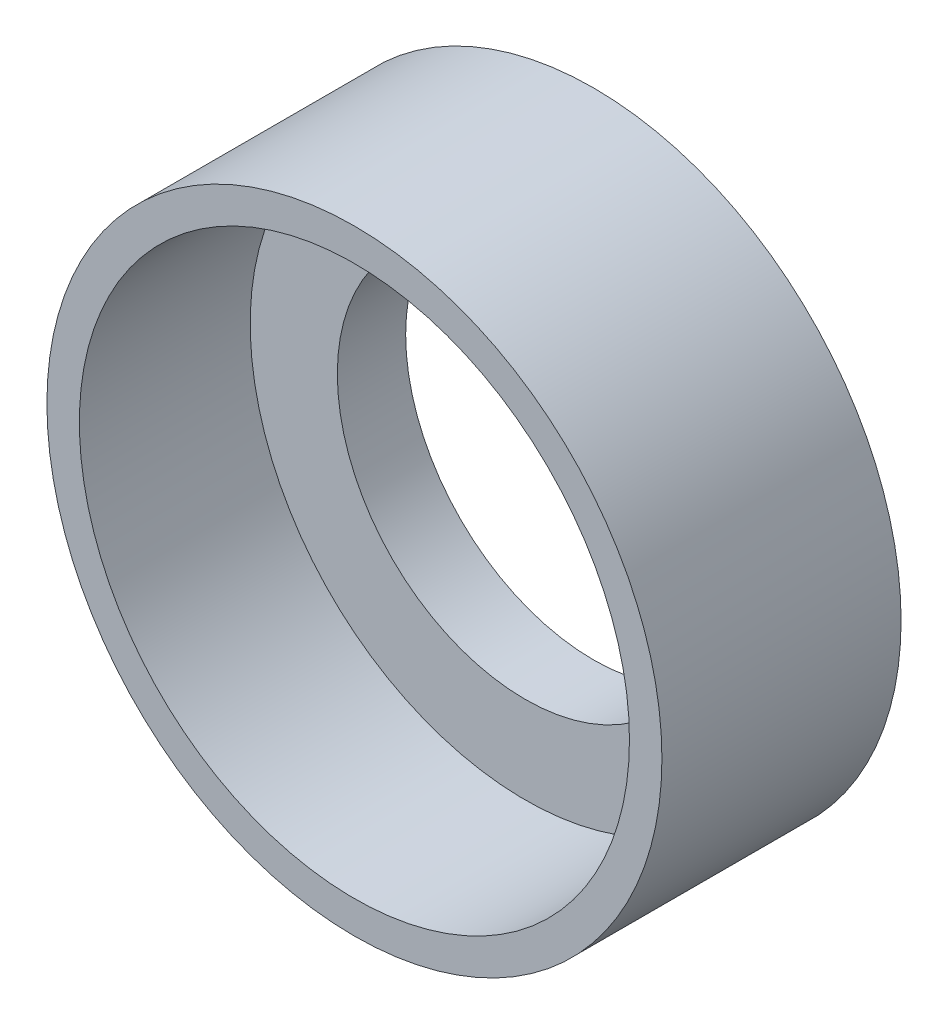
ISO-10303-21;
HEADER;
FILE_DESCRIPTION(('STEP AP214'),'2;1');
FILE_NAME('part.step','',(''),(''),'','','');
FILE_SCHEMA(('AUTOMOTIVE_DESIGN { 1 0 10303 214 1 1 1 1 }'));
ENDSEC;
DATA;
#1=APPLICATION_CONTEXT('core data for automotive mechanical design processes');
#2=APPLICATION_PROTOCOL_DEFINITION('international standard','automotive_design',2000,#1);
#3=PRODUCT_CONTEXT('',#1,'mechanical');
#4=PRODUCT('Part','Part','',(#3));
#5=PRODUCT_RELATED_PRODUCT_CATEGORY('part','',(#4));
#6=PRODUCT_DEFINITION_FORMATION('','',#4);
#7=PRODUCT_DEFINITION_CONTEXT('part definition',#1,'design');
#8=PRODUCT_DEFINITION('design','',#6,#7);
#9=PRODUCT_DEFINITION_SHAPE('','',#8);
#10=(LENGTH_UNIT() NAMED_UNIT(*) SI_UNIT(.MILLI.,.METRE.));
#11=(NAMED_UNIT(*) PLANE_ANGLE_UNIT() SI_UNIT($,.RADIAN.));
#12=(NAMED_UNIT(*) SI_UNIT($,.STERADIAN.) SOLID_ANGLE_UNIT());
#13=UNCERTAINTY_MEASURE_WITH_UNIT(LENGTH_MEASURE(1.E-05),#10,'distance_accuracy_value','');
#14=(GEOMETRIC_REPRESENTATION_CONTEXT(3) GLOBAL_UNCERTAINTY_ASSIGNED_CONTEXT((#13)) GLOBAL_UNIT_ASSIGNED_CONTEXT((#10,
#11,#12)) REPRESENTATION_CONTEXT('',''));
#15=CARTESIAN_POINT('',(0.,0.,0.));
#16=DIRECTION('',(0.,0.,1.));
#17=DIRECTION('',(1.,0.,0.));
#18=AXIS2_PLACEMENT_3D('',#15,#16,#17);
#19=CARTESIAN_POINT('',(0.,0.,2.));
#20=DIRECTION('',(0.,0.,1.));
#21=DIRECTION('',(1.,0.,0.));
#22=AXIS2_PLACEMENT_3D('',#19,#20,#21);
#23=PLANE('',#22);
#24=CARTESIAN_POINT('',(0.,0.,2.));
#25=DIRECTION('',(0.,0.,1.));
#26=DIRECTION('',(1.,0.,0.));
#27=AXIS2_PLACEMENT_3D('',#24,#25,#26);
#28=CIRCLE('',#27,5.5);
#29=CARTESIAN_POINT('',(5.5,0.,2.));
#30=VERTEX_POINT('',#29);
#31=EDGE_CURVE('E42',#30,#30,#28,.T.);
#32=ORIENTED_EDGE('',*,*,#31,.F.);
#33=EDGE_LOOP('',(#32));
#34=FACE_BOUND('',#33,.T.);
#35=CARTESIAN_POINT('',(0.,0.,2.));
#36=DIRECTION('',(0.,0.,1.));
#37=DIRECTION('',(1.,0.,0.));
#38=AXIS2_PLACEMENT_3D('',#35,#36,#37);
#39=CIRCLE('',#38,8.05);
#40=CARTESIAN_POINT('',(8.05,0.,2.));
#41=VERTEX_POINT('',#40);
#42=EDGE_CURVE('E10',#41,#41,#39,.F.);
#43=ORIENTED_EDGE('',*,*,#42,.F.);
#44=EDGE_LOOP('',(#43));
#45=FACE_BOUND('',#44,.T.);
#46=ADVANCED_FACE('F31',(#34,#45),#23,.T.);
#47=CARTESIAN_POINT('',(0.,0.,0.));
#48=DIRECTION('',(0.,0.,1.));
#49=DIRECTION('',(1.,0.,0.));
#50=AXIS2_PLACEMENT_3D('',#47,#48,#49);
#51=PLANE('',#50);
#52=CARTESIAN_POINT('',(0.,0.,0.));
#53=DIRECTION('',(0.,0.,1.));
#54=DIRECTION('',(1.,0.,0.));
#55=AXIS2_PLACEMENT_3D('',#52,#53,#54);
#56=CIRCLE('',#55,8.99999999999999);
#57=CARTESIAN_POINT('',(8.99999999999999,0.,0.));
#58=VERTEX_POINT('',#57);
#59=EDGE_CURVE('E38',#58,#58,#56,.T.);
#60=ORIENTED_EDGE('',*,*,#59,.F.);
#61=EDGE_LOOP('',(#60));
#62=FACE_BOUND('',#61,.T.);
#63=CARTESIAN_POINT('',(0.,0.,0.));
#64=DIRECTION('',(0.,0.,1.));
#65=DIRECTION('',(1.,0.,0.));
#66=AXIS2_PLACEMENT_3D('',#63,#64,#65);
#67=CIRCLE('',#66,5.5);
#68=CARTESIAN_POINT('',(5.5,0.,0.));
#69=VERTEX_POINT('',#68);
#70=EDGE_CURVE('E46',#69,#69,#67,.T.);
#71=ORIENTED_EDGE('',*,*,#70,.T.);
#72=EDGE_LOOP('',(#71));
#73=FACE_BOUND('',#72,.T.);
#74=ADVANCED_FACE('F73',(#62,#73),#51,.F.);
#75=CARTESIAN_POINT('',(0.,0.,2.));
#76=DIRECTION('',(0.,0.,-1.));
#77=DIRECTION('',(-1.,0.,0.));
#78=AXIS2_PLACEMENT_3D('',#75,#76,#77);
#79=CYLINDRICAL_SURFACE('',#78,8.99999999999999);
#80=ORIENTED_EDGE('',*,*,#59,.T.);
#81=EDGE_LOOP('',(#80));
#82=FACE_BOUND('',#81,.T.);
#83=CARTESIAN_POINT('',(0.,0.,7.));
#84=DIRECTION('',(0.,0.,1.));
#85=DIRECTION('',(1.,0.,0.));
#86=AXIS2_PLACEMENT_3D('',#83,#84,#85);
#87=CIRCLE('',#86,9.);
#88=CARTESIAN_POINT('',(9.,0.,7.));
#89=VERTEX_POINT('',#88);
#90=EDGE_CURVE('E50',#89,#89,#87,.T.);
#91=ORIENTED_EDGE('',*,*,#90,.F.);
#92=EDGE_LOOP('',(#91));
#93=FACE_BOUND('',#92,.T.);
#94=ADVANCED_FACE('F33',(#82,#93),#79,.T.);
#95=CARTESIAN_POINT('',(0.,0.,2.));
#96=DIRECTION('',(0.,0.,-1.));
#97=DIRECTION('',(-1.,0.,0.));
#98=AXIS2_PLACEMENT_3D('',#95,#96,#97);
#99=CYLINDRICAL_SURFACE('',#98,5.5);
#100=ORIENTED_EDGE('',*,*,#31,.T.);
#101=EDGE_LOOP('',(#100));
#102=FACE_BOUND('',#101,.T.);
#103=ORIENTED_EDGE('',*,*,#70,.F.);
#104=EDGE_LOOP('',(#103));
#105=FACE_BOUND('',#104,.T.);
#106=ADVANCED_FACE('F62',(#102,#105),#99,.F.);
#107=CARTESIAN_POINT('',(0.,0.,7.));
#108=DIRECTION('',(0.,0.,1.));
#109=DIRECTION('',(1.,0.,0.));
#110=AXIS2_PLACEMENT_3D('',#107,#108,#109);
#111=PLANE('',#110);
#112=ORIENTED_EDGE('',*,*,#90,.T.);
#113=EDGE_LOOP('',(#112));
#114=FACE_BOUND('',#113,.T.);
#115=CARTESIAN_POINT('',(0.,0.,7.));
#116=DIRECTION('',(0.,0.,1.));
#117=DIRECTION('',(1.,0.,0.));
#118=AXIS2_PLACEMENT_3D('',#115,#116,#117);
#119=CIRCLE('',#118,8.05);
#120=CARTESIAN_POINT('',(8.05,0.,7.));
#121=VERTEX_POINT('',#120);
#122=EDGE_CURVE('E54',#121,#121,#119,.T.);
#123=ORIENTED_EDGE('',*,*,#122,.F.);
#124=EDGE_LOOP('',(#123));
#125=FACE_BOUND('',#124,.T.);
#126=ADVANCED_FACE('F60',(#114,#125),#111,.T.);
#127=CARTESIAN_POINT('',(0.,0.,7.));
#128=DIRECTION('',(0.,0.,-1.));
#129=DIRECTION('',(-1.,0.,0.));
#130=AXIS2_PLACEMENT_3D('',#127,#128,#129);
#131=CYLINDRICAL_SURFACE('',#130,8.05);
#132=ORIENTED_EDGE('',*,*,#122,.T.);
#133=EDGE_LOOP('',(#132));
#134=FACE_BOUND('',#133,.T.);
#135=ORIENTED_EDGE('',*,*,#42,.T.);
#136=EDGE_LOOP('',(#135));
#137=FACE_BOUND('',#136,.T.);
#138=ADVANCED_FACE('F58',(#134,#137),#131,.F.);
#139=CLOSED_SHELL('',(#46,#74,#94,#106,#126,#138));
#140=MANIFOLD_SOLID_BREP('B2',#139);
#141=ADVANCED_BREP_SHAPE_REPRESENTATION('',(#18,#140),#14);
#142=SHAPE_DEFINITION_REPRESENTATION(#9,#141);
ENDSEC;
END-ISO-10303-21;
